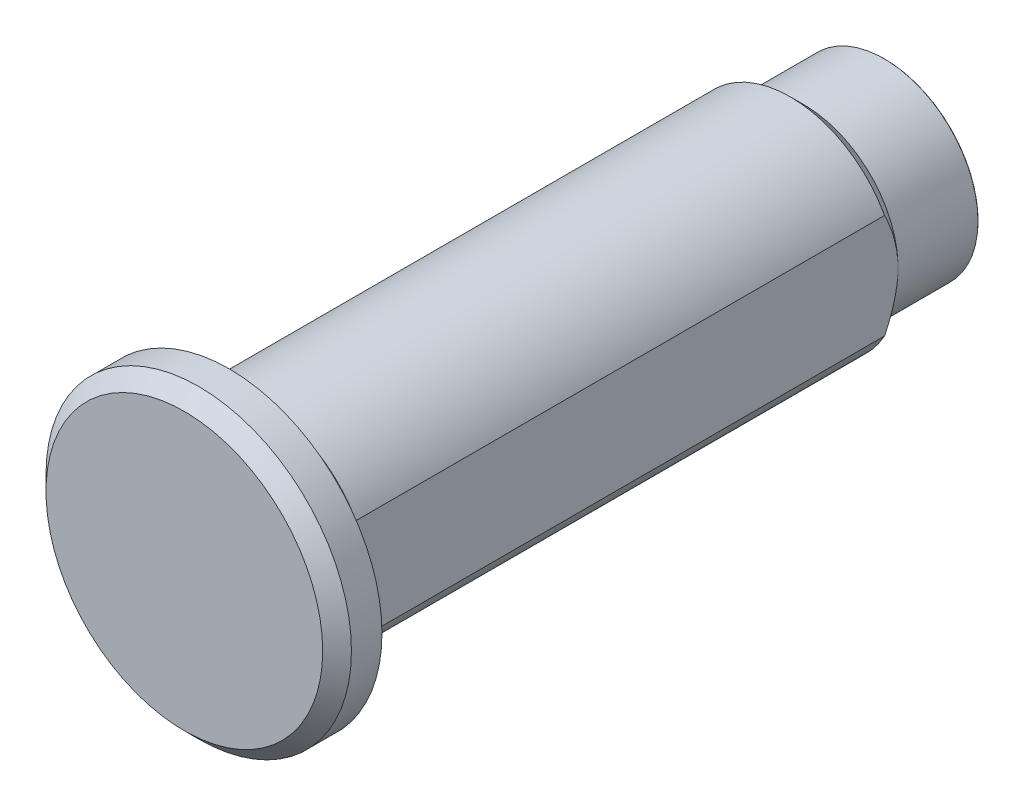
ISO-10303-21;
HEADER;
FILE_DESCRIPTION(('STEP AP214'),'2;1');
FILE_NAME('part.step','',(''),(''),'','','');
FILE_SCHEMA(('AUTOMOTIVE_DESIGN { 1 0 10303 214 1 1 1 1 }'));
ENDSEC;
DATA;
#1=APPLICATION_CONTEXT('core data for automotive mechanical design processes');
#2=APPLICATION_PROTOCOL_DEFINITION('international standard','automotive_design',2000,#1);
#3=PRODUCT_CONTEXT('',#1,'mechanical');
#4=PRODUCT('Part','Part','',(#3));
#5=PRODUCT_RELATED_PRODUCT_CATEGORY('part','',(#4));
#6=PRODUCT_DEFINITION_FORMATION('','',#4);
#7=PRODUCT_DEFINITION_CONTEXT('part definition',#1,'design');
#8=PRODUCT_DEFINITION('design','',#6,#7);
#9=PRODUCT_DEFINITION_SHAPE('','',#8);
#10=(LENGTH_UNIT() NAMED_UNIT(*) SI_UNIT(.MILLI.,.METRE.));
#11=(NAMED_UNIT(*) PLANE_ANGLE_UNIT() SI_UNIT($,.RADIAN.));
#12=(NAMED_UNIT(*) SI_UNIT($,.STERADIAN.) SOLID_ANGLE_UNIT());
#13=UNCERTAINTY_MEASURE_WITH_UNIT(LENGTH_MEASURE(1.E-05),#10,'distance_accuracy_value','');
#14=(GEOMETRIC_REPRESENTATION_CONTEXT(3) GLOBAL_UNCERTAINTY_ASSIGNED_CONTEXT((#13)) GLOBAL_UNIT_ASSIGNED_CONTEXT((#10,
#11,#12)) REPRESENTATION_CONTEXT('',''));
#15=CARTESIAN_POINT('',(0.,0.,0.));
#16=DIRECTION('',(0.,0.,1.));
#17=DIRECTION('',(1.,0.,0.));
#18=AXIS2_PLACEMENT_3D('',#15,#16,#17);
#19=CARTESIAN_POINT('',(0.,0.,36.5));
#20=DIRECTION('',(0.,0.,1.));
#21=DIRECTION('',(1.,0.,0.));
#22=AXIS2_PLACEMENT_3D('',#19,#20,#21);
#23=PLANE('',#22);
#24=CARTESIAN_POINT('',(0.,0.,36.5));
#25=DIRECTION('',(0.,0.,1.));
#26=DIRECTION('',(1.,0.,0.));
#27=AXIS2_PLACEMENT_3D('',#24,#25,#26);
#28=CIRCLE('',#27,5.2);
#29=CARTESIAN_POINT('',(5.2,0.,36.5));
#30=VERTEX_POINT('',#29);
#31=EDGE_CURVE('E119',#30,#30,#28,.T.);
#32=ORIENTED_EDGE('',*,*,#31,.T.);
#33=EDGE_LOOP('',(#32));
#34=FACE_BOUND('',#33,.T.);
#35=CARTESIAN_POINT('',(0.,0.,36.5));
#36=DIRECTION('',(0.,0.,-1.));
#37=DIRECTION('',(1.,0.,0.));
#38=AXIS2_PLACEMENT_3D('',#35,#36,#37);
#39=CIRCLE('',#38,6.);
#40=CARTESIAN_POINT('',(6.,0.,36.5));
#41=VERTEX_POINT('',#40);
#42=EDGE_CURVE('E249',#41,#41,#39,.T.);
#43=ORIENTED_EDGE('',*,*,#42,.T.);
#44=EDGE_LOOP('',(#43));
#45=FACE_BOUND('',#44,.T.);
#46=ADVANCED_FACE('F43',(#34,#45),#23,.F.);
#47=CARTESIAN_POINT('',(0.,0.,19.9875));
#48=DIRECTION('',(0.,0.,-1.));
#49=DIRECTION('',(-1.,0.,0.));
#50=AXIS2_PLACEMENT_3D('',#47,#48,#49);
#51=CYLINDRICAL_SURFACE('',#50,6.);
#52=DIRECTION('',(0.,0.,1.));
#53=VECTOR('',#52,1.);
#54=CARTESIAN_POINT('',(5.25,2.90473750965556,4.5));
#55=LINE('',#54,#53);
#56=CARTESIAN_POINT('',(5.25,2.90473750952479,34.6999999997299));
#57=VERTEX_POINT('',#56);
#58=CARTESIAN_POINT('',(5.25,2.90473750933291,5.27500000053737));
#59=VERTEX_POINT('',#58);
#60=EDGE_CURVE('E96',#57,#59,#55,.F.);
#61=ORIENTED_EDGE('',*,*,#60,.T.);
#62=CARTESIAN_POINT('',(0.,0.,5.27500000038117));
#63=DIRECTION('',(0.,0.,1.));
#64=DIRECTION('',(1.,0.,0.));
#65=AXIS2_PLACEMENT_3D('',#62,#63,#64);
#66=CIRCLE('',#65,5.99999999968759);
#67=CARTESIAN_POINT('',(-5.25,2.90473750933291,5.27500000038117));
#68=VERTEX_POINT('',#67);
#69=EDGE_CURVE('E90',#68,#59,#66,.F.);
#70=ORIENTED_EDGE('',*,*,#69,.F.);
#71=DIRECTION('',(0.,0.,-1.));
#72=VECTOR('',#71,1.);
#73=CARTESIAN_POINT('',(-5.25,2.90473750965557,4.5));
#74=LINE('',#73,#72);
#75=CARTESIAN_POINT('',(-5.25,2.90473750965557,34.6999999996666));
#76=VERTEX_POINT('',#75);
#77=EDGE_CURVE('E97',#68,#76,#74,.F.);
#78=ORIENTED_EDGE('',*,*,#77,.T.);
#79=CARTESIAN_POINT('',(0.,0.,34.7));
#80=DIRECTION('',(0.,0.,-1.));
#81=DIRECTION('',(-1.,0.,0.));
#82=AXIS2_PLACEMENT_3D('',#79,#80,#81);
#83=CIRCLE('',#82,6.);
#84=EDGE_CURVE('E104',#76,#57,#83,.T.);
#85=ORIENTED_EDGE('',*,*,#84,.T.);
#86=EDGE_LOOP('',(#61,#70,#78,#85));
#87=FACE_BOUND('',#86,.T.);
#88=ADVANCED_FACE('F101',(#87),#51,.T.);
#89=CARTESIAN_POINT('',(-5.25,2.90473750965557,4.5));
#90=DIRECTION('',(1.,0.,0.));
#91=DIRECTION('',(0.,0.,-1.));
#92=AXIS2_PLACEMENT_3D('',#89,#90,#91);
#93=PLANE('',#92);
#94=DIRECTION('',(0.,0.,-1.));
#95=VECTOR('',#94,1.);
#96=CARTESIAN_POINT('',(-5.25,-2.90473750965556,19.9875));
#97=LINE('',#96,#95);
#98=CARTESIAN_POINT('',(-5.25,-2.90473750965556,34.6999999996666));
#99=VERTEX_POINT('',#98);
#100=CARTESIAN_POINT('',(-5.25,-2.90473750952292,5.27500000028258));
#101=VERTEX_POINT('',#100);
#102=EDGE_CURVE('E112',#99,#101,#97,.T.);
#103=ORIENTED_EDGE('',*,*,#102,.F.);
#104=CARTESIAN_POINT('',(-5.25000000014036,2.90473750942371,34.6999999995211));
#105=CARTESIAN_POINT('',(-5.25000000005173,2.80472364249901,34.7484127450891));
#106=CARTESIAN_POINT('',(-5.25000000001417,2.70396282733897,34.7952855235719));
#107=CARTESIAN_POINT('',(-5.24999999998582,2.50082737605574,34.8855062666034));
#108=CARTESIAN_POINT('',(-5.24999999999506,2.39845207813469,34.9288527383425));
#109=CARTESIAN_POINT('',(-5.25000000000994,2.08773843913795,35.0533212458188));
#110=CARTESIAN_POINT('',(-5.25000000000253,1.87688996107605,35.1283396214557));
#111=CARTESIAN_POINT('',(-5.24999999999748,1.44960363662519,35.2573261898471));
#112=CARTESIAN_POINT('',(-5.24999999999981,1.23319217234919,35.3113792075725));
#113=CARTESIAN_POINT('',(-5.2500000000001,0.905325852034298,35.373595250369));
#114=CARTESIAN_POINT('',(-5.24999999999966,0.795619790655084,35.3911808711925));
#115=CARTESIAN_POINT('',(-5.25000000000034,0.575357914022909,35.4196935829661));
#116=CARTESIAN_POINT('',(-5.25000000000146,0.464802371205453,35.4306227252794));
#117=CARTESIAN_POINT('',(-5.24999999999922,0.29509634463016,35.4420423388852));
#118=CARTESIAN_POINT('',(-5.24999999999772,0.236104114980286,35.4450243697781));
#119=CARTESIAN_POINT('',(-5.25000000000228,0.118077181188113,35.449003787367));
#120=CARTESIAN_POINT('',(-5.25000000000834,0.0590425019471778,35.4500019332948));
#121=CARTESIAN_POINT('',(-5.25000000001943,-0.159349296907837,35.4499947849231));
#122=CARTESIAN_POINT('',(-5.25000000000521,-0.318755574520894,35.4427049828945));
#123=CARTESIAN_POINT('',(-5.24999999999479,-0.636346232490033,35.4139454844968));
#124=CARTESIAN_POINT('',(-5.2499999999986,-0.794529662094433,35.3924656962197));
#125=CARTESIAN_POINT('',(-5.25000000000141,-1.10921364817354,35.3363470199826));
#126=CARTESIAN_POINT('',(-5.25000000000038,-1.26570419082673,35.3016525748727));
#127=CARTESIAN_POINT('',(-5.24999999999962,-1.57567343162152,35.2206901976528));
#128=CARTESIAN_POINT('',(-5.24999999999989,-1.72915105880267,35.1744182277871));
#129=CARTESIAN_POINT('',(-5.25000000000012,-2.05674952786255,35.0639273749439));
#130=CARTESIAN_POINT('',(-5.25000000000002,-2.23030107141181,34.9980280715673));
#131=CARTESIAN_POINT('',(-5.24999999999999,-2.48651857129637,34.8914452741755));
#132=CARTESIAN_POINT('',(-5.24999999999999,-2.57090217438363,34.8547943626977));
#133=CARTESIAN_POINT('',(-5.25000000000001,-2.7386063393495,34.7791153486981));
#134=CARTESIAN_POINT('',(-5.25000000000001,-2.82192681236011,34.7400870490024));
#135=CARTESIAN_POINT('',(-5.25,-2.90473750942253,34.699999999446));
#136=B_SPLINE_CURVE_WITH_KNOTS('',3,(#104,#105,#106,#107,#108,#109,#110,#111,#112,#113,#114,
#115,#116,#117,#118,#119,#120,#121,#122,#123,#124,#125,#126,#127,#128,#129,#130,#131,#132,#133,
#134,#135),.UNSPECIFIED.,.F.,.F.,(4,2,2,2,2,2,2,2,2,2,2,2,2,2,2,4),(0.,0.333326180451042,
0.666792743150029,1.33732321864376,2.00511172853406,2.33826323974814,2.67131202983978,
2.8484843643836,3.02558888210336,3.50357473038419,3.98190088835122,4.46226063118257,
4.9427881374586,5.49923054934731,5.77520069740091,6.05119376488153),.UNSPECIFIED.);
#137=EDGE_CURVE('E80',#76,#99,#136,.T.);
#138=ORIENTED_EDGE('',*,*,#137,.F.);
#139=ORIENTED_EDGE('',*,*,#77,.F.);
#140=CARTESIAN_POINT('',(-5.25000000014974,-2.90473750942195,5.27500000049974));
#141=CARTESIAN_POINT('',(-5.2500000000552,-2.80472364249426,5.22658725493416));
#142=CARTESIAN_POINT('',(-5.25000000001512,-2.70396282733191,5.17971447645242));
#143=CARTESIAN_POINT('',(-5.24999999998487,-2.50082737604467,5.08949373342163));
#144=CARTESIAN_POINT('',(-5.24999999999472,-2.3984520781219,5.04614726168227));
#145=CARTESIAN_POINT('',(-5.25000000001062,-2.08773843912013,4.92167875420576));
#146=CARTESIAN_POINT('',(-5.25000000000278,-1.87688996105472,4.8466603785695));
#147=CARTESIAN_POINT('',(-5.24999999999723,-1.44960363659879,4.71767381018028));
#148=CARTESIAN_POINT('',(-5.2499999999995,-1.23319217232128,4.66362079245634));
#149=CARTESIAN_POINT('',(-5.25000000000025,-0.905325852004177,4.60140474966175));
#150=CARTESIAN_POINT('',(-5.25000000000007,-0.795619790624202,4.58381912883896));
#151=CARTESIAN_POINT('',(-5.24999999999993,-0.575357913990496,4.55530641706711));
#152=CARTESIAN_POINT('',(-5.24999999999999,-0.46480237117227,4.54437727475502));
#153=CARTESIAN_POINT('',(-5.25000000000001,-0.295096344601979,4.53295766114993));
#154=CARTESIAN_POINT('',(-5.25,-0.236104114957861,4.52997563025703));
#155=CARTESIAN_POINT('',(-5.25,-0.118077181177136,4.52599621267076));
#156=CARTESIAN_POINT('',(-5.25,-0.0590425019418932,4.52499806674567));
#157=CARTESIAN_POINT('',(-5.25,0.159349296909903,4.52500521512197));
#158=CARTESIAN_POINT('',(-5.25,0.318755574525442,4.53229501714478));
#159=CARTESIAN_POINT('',(-5.25,0.636346232499038,4.56105451553863));
#160=CARTESIAN_POINT('',(-5.25,0.794529662105417,4.58253430381755));
#161=CARTESIAN_POINT('',(-5.25,1.10921364818837,4.63865298005651));
#162=CARTESIAN_POINT('',(-5.25,1.26570419084342,4.67334742516632));
#163=CARTESIAN_POINT('',(-5.25,1.57567343164181,4.75430980238672));
#164=CARTESIAN_POINT('',(-5.25,1.72915105882469,4.80058177225298));
#165=CARTESIAN_POINT('',(-5.25,2.05674952787655,4.91107262509329));
#166=CARTESIAN_POINT('',(-5.25,2.23030107141637,4.9769719284656));
#167=CARTESIAN_POINT('',(-5.25,2.4865185712875,5.08355472585011));
#168=CARTESIAN_POINT('',(-5.25,2.57090217437057,5.12020563732544));
#169=CARTESIAN_POINT('',(-5.25,2.73860633932816,5.19588465131993));
#170=CARTESIAN_POINT('',(-5.25,2.82192681233468,5.23491295101292));
#171=CARTESIAN_POINT('',(-5.25,2.90473750939307,5.2750000005665));
#172=B_SPLINE_CURVE_WITH_KNOTS('',3,(#140,#141,#142,#143,#144,#145,#146,#147,#148,#149,#150,
#151,#152,#153,#154,#155,#156,#157,#158,#159,#160,#161,#162,#163,#164,#165,#166,#167,#168,#169,
#170,#171),.UNSPECIFIED.,.F.,.F.,(4,2,2,2,2,2,2,2,2,2,2,2,2,2,2,4),(0.,0.333326180456037,
0.666792743160119,1.33732321866301,2.00511172855676,2.33826323977274,2.67131202986644,
2.84848436439296,3.02558888209554,3.50357473038353,3.98190088835662,4.46226063119367,
4.94278813747504,5.49923054933277,5.7752006973719,6.05119376483797),.UNSPECIFIED.);
#173=EDGE_CURVE('E86',#101,#68,#172,.T.);
#174=ORIENTED_EDGE('',*,*,#173,.F.);
#175=EDGE_LOOP('',(#103,#138,#139,#174));
#176=FACE_BOUND('',#175,.T.);
#177=ADVANCED_FACE('F106',(#176),#93,.F.);
#178=CARTESIAN_POINT('',(0.,0.,5.27500000038117));
#179=DIRECTION('',(0.,0.,1.));
#180=DIRECTION('',(1.,0.,0.));
#181=AXIS2_PLACEMENT_3D('',#178,#179,#180);
#182=CONICAL_SURFACE('',#181,5.99999999968759,0.785398162480619);
#183=CARTESIAN_POINT('',(5.25000000005051,2.90473750940096,5.27500000054309));
#184=CARTESIAN_POINT('',(5.25000000001862,2.80472364248735,5.22658725495055));
#185=CARTESIAN_POINT('',(5.2500000000051,2.70396282733174,5.17971447645771));
#186=CARTESIAN_POINT('',(5.2499999999949,2.50082737605147,5.08949373341929));
#187=CARTESIAN_POINT('',(5.24999999999822,2.39845207812897,5.0461472616834));
#188=CARTESIAN_POINT('',(5.25000000000358,2.08773843913055,4.92167875421336));
#189=CARTESIAN_POINT('',(5.25000000000094,1.87688996107021,4.84666037857581));
#190=CARTESIAN_POINT('',(5.24999999999907,1.44960363662393,4.71767381018625));
#191=CARTESIAN_POINT('',(5.24999999999983,1.23319217235102,4.66362079246318));
#192=CARTESIAN_POINT('',(5.25000000000008,0.90532585204112,4.60140474966815));
#193=CARTESIAN_POINT('',(5.25000000000002,0.795619790663541,4.58381912884493));
#194=CARTESIAN_POINT('',(5.24999999999998,0.57535791403456,4.55530641707194));
#195=CARTESIAN_POINT('',(5.25,0.464802371218662,4.54437727475916));
#196=CARTESIAN_POINT('',(5.25,0.295096344642614,4.53295766115212));
#197=CARTESIAN_POINT('',(5.25,0.236104114990406,4.5299756302584));
#198=CARTESIAN_POINT('',(5.25,0.118077181193477,4.52599621267104));
#199=CARTESIAN_POINT('',(5.25,0.0590425019501209,4.52499806674567));
#200=CARTESIAN_POINT('',(5.25,-0.159349296909819,4.52500521512197));
#201=CARTESIAN_POINT('',(5.25,-0.318755574525381,4.53229501714477));
#202=CARTESIAN_POINT('',(5.25,-0.63634623249902,4.56105451553863));
#203=CARTESIAN_POINT('',(5.25,-0.794529662105418,4.58253430381755));
#204=CARTESIAN_POINT('',(5.25,-1.1092136481884,4.63865298005652));
#205=CARTESIAN_POINT('',(5.25,-1.26570419084347,4.67334742516633));
#206=CARTESIAN_POINT('',(5.25,-1.57567343164188,4.75430980238674));
#207=CARTESIAN_POINT('',(5.25,-1.72915105882477,4.800581772253));
#208=CARTESIAN_POINT('',(5.25,-2.05674952787636,4.91107262509323));
#209=CARTESIAN_POINT('',(5.25,-2.2303010714159,4.97697192846542));
#210=CARTESIAN_POINT('',(5.25,-2.48651857128664,5.08355472584974));
#211=CARTESIAN_POINT('',(5.25,-2.57090217436958,5.12020563732501));
#212=CARTESIAN_POINT('',(5.25,-2.73860633932693,5.19588465131936));
#213=CARTESIAN_POINT('',(5.25,-2.82192681233332,5.23491295101227));
#214=CARTESIAN_POINT('',(5.25,-2.90473750939159,5.27500000056579));
#215=B_SPLINE_CURVE_WITH_KNOTS('',3,(#183,#184,#185,#186,#187,#188,#189,#190,#191,#192,#193,
#194,#195,#196,#197,#198,#199,#200,#201,#202,#203,#204,#205,#206,#207,#208,#209,#210,#211,#212,
#213,#214),.UNSPECIFIED.,.F.,.F.,(4,2,2,2,2,2,2,2,2,2,2,2,2,2,2,4),(0.,0.333326180451773,
0.66679274315076,1.33732321864137,2.00511172852079,2.33826323972994,2.6713120298169,
2.84848436436777,3.02558888209469,3.50357473038276,3.9819008883559,4.46226063119299,
4.9427881374744,5.49923054933124,5.77520069736994,6.05119376483559),.UNSPECIFIED.);
#216=CARTESIAN_POINT('',(5.25,-2.90473750951956,5.27500000028095));
#217=VERTEX_POINT('',#216);
#218=EDGE_CURVE('E144',#59,#217,#215,.T.);
#219=ORIENTED_EDGE('',*,*,#218,.T.);
#220=CARTESIAN_POINT('',(0.,0.,5.275));
#221=DIRECTION('',(0.,0.,-1.));
#222=DIRECTION('',(-1.,0.,0.));
#223=AXIS2_PLACEMENT_3D('',#220,#221,#222);
#224=CIRCLE('',#223,6.);
#225=EDGE_CURVE('E93',#101,#217,#224,.F.);
#226=ORIENTED_EDGE('',*,*,#225,.F.);
#227=ORIENTED_EDGE('',*,*,#173,.T.);
#228=ORIENTED_EDGE('',*,*,#69,.T.);
#229=EDGE_LOOP('',(#219,#226,#227,#228));
#230=FACE_BOUND('',#229,.T.);
#231=CARTESIAN_POINT('',(0.,0.,4.49999999966622));
#232=DIRECTION('',(0.,0.,-1.));
#233=DIRECTION('',(-1.,0.,0.));
#234=AXIS2_PLACEMENT_3D('',#231,#232,#233);
#235=CIRCLE('',#234,5.225);
#236=CARTESIAN_POINT('',(-5.225,0.,4.49999999966622));
#237=VERTEX_POINT('',#236);
#238=EDGE_CURVE('E528',#237,#237,#235,.T.);
#239=ORIENTED_EDGE('',*,*,#238,.F.);
#240=EDGE_LOOP('',(#239));
#241=FACE_BOUND('',#240,.T.);
#242=ADVANCED_FACE('F88',(#230,#241),#182,.T.);
#243=CARTESIAN_POINT('',(5.25,-2.90473750965557,4.5));
#244=DIRECTION('',(-1.,0.,0.));
#245=DIRECTION('',(0.,0.,1.));
#246=AXIS2_PLACEMENT_3D('',#243,#244,#245);
#247=PLANE('',#246);
#248=ORIENTED_EDGE('',*,*,#60,.F.);
#249=CARTESIAN_POINT('',(5.25000000012699,-2.90473750944238,34.6999999995048));
#250=CARTESIAN_POINT('',(5.25000000004681,-2.80472364251846,34.7484127450773));
#251=CARTESIAN_POINT('',(5.25000000001282,-2.70396282735821,34.7952855235623));
#252=CARTESIAN_POINT('',(5.24999999998717,-2.50082737607363,34.8855062665964));
#253=CARTESIAN_POINT('',(5.24999999999552,-2.39845207815144,34.9288527383357));
#254=CARTESIAN_POINT('',(5.25000000000901,-2.08773843915195,35.0533212458132));
#255=CARTESIAN_POINT('',(5.25000000000235,-1.87688996108864,35.1283396214514));
#256=CARTESIAN_POINT('',(5.24999999999766,-1.44960363663653,35.2573261898442));
#257=CARTESIAN_POINT('',(5.24999999999957,-1.23319217236072,35.3113792075698));
#258=CARTESIAN_POINT('',(5.25000000000021,-0.905325852046081,35.3735952503671));
#259=CARTESIAN_POINT('',(5.25000000000006,-0.795619790666899,35.3911808711909));
#260=CARTESIAN_POINT('',(5.24999999999994,-0.575357914034708,35.4196935829647));
#261=CARTESIAN_POINT('',(5.24999999999999,-0.464802371217202,35.4306227252778));
#262=CARTESIAN_POINT('',(5.25000000000001,-0.295096344640089,35.442042338885));
#263=CARTESIAN_POINT('',(5.25,-0.236104114988437,35.4450243697787));
#264=CARTESIAN_POINT('',(5.25,-0.118077181192626,35.449003787366));
#265=CARTESIAN_POINT('',(5.25,-0.0590425019498308,35.4500019332914));
#266=CARTESIAN_POINT('',(5.25,0.159349296907621,35.4499947849151));
#267=CARTESIAN_POINT('',(5.25,0.318755574521257,35.4427049828924));
#268=CARTESIAN_POINT('',(5.25,0.636346232491056,35.4139454844988));
#269=CARTESIAN_POINT('',(5.25,0.794529662095541,35.3924656962201));
#270=CARTESIAN_POINT('',(5.25,1.10921364817474,35.3363470199818));
#271=CARTESIAN_POINT('',(5.25,1.26570419082793,35.3016525748723));
#272=CARTESIAN_POINT('',(5.25,1.5756734316226,35.2206901976527));
#273=CARTESIAN_POINT('',(5.25,1.72915105880364,35.1744182277868));
#274=CARTESIAN_POINT('',(5.25,2.05674952785936,35.0639273749449));
#275=CARTESIAN_POINT('',(5.25,2.23030107140467,34.99802807157));
#276=CARTESIAN_POINT('',(5.25,2.48651857128372,34.8914452741809));
#277=CARTESIAN_POINT('',(5.25,2.57090217436935,34.854794362704));
#278=CARTESIAN_POINT('',(5.25,2.73860633933196,34.7791153487062));
#279=CARTESIAN_POINT('',(5.25,2.82192681234095,34.7400870490114));
#280=CARTESIAN_POINT('',(5.25,2.90473750940176,34.699999999456));
#281=B_SPLINE_CURVE_WITH_KNOTS('',3,(#249,#250,#251,#252,#253,#254,#255,#256,#257,#258,#259,
#260,#261,#262,#263,#264,#265,#266,#267,#268,#269,#270,#271,#272,#273,#274,#275,#276,#277,#278,
#279,#280),.UNSPECIFIED.,.F.,.F.,(4,2,2,2,2,2,2,2,2,2,2,2,2,2,2,4),(0.,0.333326180454525,
0.666792743156902,1.337323218656,2.00511172854588,2.33826323975998,2.67131202985182,
2.84848436440103,3.02558888212626,3.50357473040855,3.98190088837592,4.46226063120729,
4.94278813748299,5.4992305493589,5.77520069740696,6.05119376488195),.UNSPECIFIED.);
#282=CARTESIAN_POINT('',(5.25,-2.90473750953555,34.6999999997247));
#283=VERTEX_POINT('',#282);
#284=EDGE_CURVE('E60',#283,#57,#281,.T.);
#285=ORIENTED_EDGE('',*,*,#284,.F.);
#286=DIRECTION('',(0.,0.,-1.));
#287=VECTOR('',#286,1.);
#288=CARTESIAN_POINT('',(5.25,-2.90473750965557,19.9875));
#289=LINE('',#288,#287);
#290=EDGE_CURVE('E258',#217,#283,#289,.F.);
#291=ORIENTED_EDGE('',*,*,#290,.F.);
#292=ORIENTED_EDGE('',*,*,#218,.F.);
#293=EDGE_LOOP('',(#248,#285,#291,#292));
#294=FACE_BOUND('',#293,.T.);
#295=ADVANCED_FACE('F167',(#294),#247,.F.);
#296=CARTESIAN_POINT('',(0.,0.,34.6999999997024));
#297=DIRECTION('',(0.,0.,-1.));
#298=DIRECTION('',(-1.,0.,0.));
#299=AXIS2_PLACEMENT_3D('',#296,#297,#298);
#300=CONICAL_SURFACE('',#299,5.99999999963075,0.785398162473743);
#301=ORIENTED_EDGE('',*,*,#284,.T.);
#302=ORIENTED_EDGE('',*,*,#84,.F.);
#303=ORIENTED_EDGE('',*,*,#137,.T.);
#304=CARTESIAN_POINT('',(0.,0.,34.7));
#305=DIRECTION('',(0.,0.,-1.));
#306=DIRECTION('',(-1.,0.,0.));
#307=AXIS2_PLACEMENT_3D('',#304,#305,#306);
#308=CIRCLE('',#307,6.);
#309=EDGE_CURVE('E260',#283,#99,#308,.T.);
#310=ORIENTED_EDGE('',*,*,#309,.F.);
#311=EDGE_LOOP('',(#301,#302,#303,#310));
#312=FACE_BOUND('',#311,.T.);
#313=CARTESIAN_POINT('',(0.,0.,35.5000000004111));
#314=DIRECTION('',(0.,0.,1.));
#315=DIRECTION('',(1.,0.,0.));
#316=AXIS2_PLACEMENT_3D('',#313,#314,#315);
#317=CIRCLE('',#316,5.2);
#318=CARTESIAN_POINT('',(5.2,0.,35.5000000004111));
#319=VERTEX_POINT('',#318);
#320=EDGE_CURVE('E242',#319,#319,#317,.T.);
#321=ORIENTED_EDGE('',*,*,#320,.F.);
#322=EDGE_LOOP('',(#321));
#323=FACE_BOUND('',#322,.T.);
#324=ADVANCED_FACE('F212',(#312,#323),#300,.T.);
#325=CARTESIAN_POINT('',(0.,0.,19.9875));
#326=DIRECTION('',(0.,0.,-1.));
#327=DIRECTION('',(-1.,0.,0.));
#328=AXIS2_PLACEMENT_3D('',#325,#326,#327);
#329=CYLINDRICAL_SURFACE('',#328,6.);
#330=ORIENTED_EDGE('',*,*,#290,.T.);
#331=ORIENTED_EDGE('',*,*,#309,.T.);
#332=ORIENTED_EDGE('',*,*,#102,.T.);
#333=ORIENTED_EDGE('',*,*,#225,.T.);
#334=EDGE_LOOP('',(#330,#331,#332,#333));
#335=FACE_BOUND('',#334,.T.);
#336=ADVANCED_FACE('F200',(#335),#329,.T.);
#337=CARTESIAN_POINT('',(0.,0.,36.5));
#338=DIRECTION('',(0.,0.,-1.));
#339=DIRECTION('',(-1.,0.,0.));
#340=AXIS2_PLACEMENT_3D('',#337,#338,#339);
#341=CYLINDRICAL_SURFACE('',#340,5.2);
#342=ORIENTED_EDGE('',*,*,#31,.F.);
#343=EDGE_LOOP('',(#342));
#344=FACE_BOUND('',#343,.T.);
#345=ORIENTED_EDGE('',*,*,#320,.T.);
#346=EDGE_LOOP('',(#345));
#347=FACE_BOUND('',#346,.T.);
#348=ADVANCED_FACE('F178',(#344,#347),#341,.T.);
#349=CARTESIAN_POINT('',(0.,0.,37.65));
#350=DIRECTION('',(0.,0.,-1.));
#351=DIRECTION('',(-1.,0.,0.));
#352=AXIS2_PLACEMENT_3D('',#349,#350,#351);
#353=CYLINDRICAL_SURFACE('',#352,7.8);
#354=CARTESIAN_POINT('',(0.,0.,37.45));
#355=DIRECTION('',(0.,0.,1.));
#356=DIRECTION('',(1.,0.,0.));
#357=AXIS2_PLACEMENT_3D('',#354,#355,#356);
#358=CIRCLE('',#357,7.8);
#359=CARTESIAN_POINT('',(7.8,0.,37.45));
#360=VERTEX_POINT('',#359);
#361=EDGE_CURVE('E12',#360,#360,#358,.T.);
#362=ORIENTED_EDGE('',*,*,#361,.T.);
#363=EDGE_LOOP('',(#362));
#364=FACE_BOUND('',#363,.T.);
#365=CARTESIAN_POINT('',(0.,0.,36.5));
#366=DIRECTION('',(0.,0.,-1.));
#367=DIRECTION('',(1.,0.,0.));
#368=AXIS2_PLACEMENT_3D('',#365,#366,#367);
#369=CIRCLE('',#368,7.8);
#370=CARTESIAN_POINT('',(7.8,0.,36.5));
#371=VERTEX_POINT('',#370);
#372=EDGE_CURVE('E243',#371,#371,#369,.T.);
#373=ORIENTED_EDGE('',*,*,#372,.T.);
#374=EDGE_LOOP('',(#373));
#375=FACE_BOUND('',#374,.T.);
#376=ADVANCED_FACE('F219',(#364,#375),#353,.F.);
#377=CARTESIAN_POINT('',(0.,0.,37.65));
#378=DIRECTION('',(0.,0.,1.));
#379=DIRECTION('',(1.,0.,0.));
#380=AXIS2_PLACEMENT_3D('',#377,#378,#379);
#381=PLANE('',#380);
#382=CARTESIAN_POINT('',(0.,0.,37.65));
#383=DIRECTION('',(0.,0.,1.));
#384=DIRECTION('',(1.,0.,0.));
#385=AXIS2_PLACEMENT_3D('',#382,#383,#384);
#386=CIRCLE('',#385,6.2);
#387=CARTESIAN_POINT('',(6.2,0.,37.65));
#388=VERTEX_POINT('',#387);
#389=EDGE_CURVE('E52',#388,#388,#386,.T.);
#390=ORIENTED_EDGE('',*,*,#389,.T.);
#391=EDGE_LOOP('',(#390));
#392=FACE_BOUND('',#391,.T.);
#393=CARTESIAN_POINT('',(0.,0.,37.65));
#394=DIRECTION('',(0.,0.,1.));
#395=DIRECTION('',(1.,0.,0.));
#396=AXIS2_PLACEMENT_3D('',#393,#394,#395);
#397=CIRCLE('',#396,7.6);
#398=CARTESIAN_POINT('',(7.6,0.,37.65));
#399=VERTEX_POINT('',#398);
#400=EDGE_CURVE('E344',#399,#399,#397,.F.);
#401=ORIENTED_EDGE('',*,*,#400,.T.);
#402=EDGE_LOOP('',(#401));
#403=FACE_BOUND('',#402,.T.);
#404=ADVANCED_FACE('F348',(#392,#403),#381,.F.);
#405=CARTESIAN_POINT('',(0.,0.,37.65));
#406=DIRECTION('',(0.,0.,-1.));
#407=DIRECTION('',(-1.,0.,0.));
#408=AXIS2_PLACEMENT_3D('',#405,#406,#407);
#409=CYLINDRICAL_SURFACE('',#408,6.);
#410=CARTESIAN_POINT('',(0.,0.,37.45));
#411=DIRECTION('',(0.,0.,1.));
#412=DIRECTION('',(1.,0.,0.));
#413=AXIS2_PLACEMENT_3D('',#410,#411,#412);
#414=CIRCLE('',#413,6.);
#415=CARTESIAN_POINT('',(6.,0.,37.45));
#416=VERTEX_POINT('',#415);
#417=EDGE_CURVE('E341',#416,#416,#414,.F.);
#418=ORIENTED_EDGE('',*,*,#417,.T.);
#419=EDGE_LOOP('',(#418));
#420=FACE_BOUND('',#419,.T.);
#421=ORIENTED_EDGE('',*,*,#42,.F.);
#422=EDGE_LOOP('',(#421));
#423=FACE_BOUND('',#422,.T.);
#424=ADVANCED_FACE('F232',(#420,#423),#409,.T.);
#425=CARTESIAN_POINT('',(0.,0.,39.));
#426=DIRECTION('',(0.,0.,1.));
#427=DIRECTION('',(1.,0.,0.));
#428=AXIS2_PLACEMENT_3D('',#425,#426,#427);
#429=PLANE('',#428);
#430=CARTESIAN_POINT('',(0.,0.,39.));
#431=DIRECTION('',(0.,0.,1.));
#432=DIRECTION('',(1.,0.,0.));
#433=AXIS2_PLACEMENT_3D('',#430,#431,#432);
#434=CIRCLE('',#433,7.70000000071798);
#435=CARTESIAN_POINT('',(7.70000000071798,0.,39.));
#436=VERTEX_POINT('',#435);
#437=EDGE_CURVE('E338',#436,#436,#434,.T.);
#438=ORIENTED_EDGE('',*,*,#437,.T.);
#439=EDGE_LOOP('',(#438));
#440=FACE_BOUND('',#439,.T.);
#441=ADVANCED_FACE('F227',(#440),#429,.T.);
#442=CARTESIAN_POINT('',(0.,0.,39.));
#443=DIRECTION('',(0.,0.,-1.));
#444=DIRECTION('',(-1.,0.,0.));
#445=AXIS2_PLACEMENT_3D('',#442,#443,#444);
#446=CYLINDRICAL_SURFACE('',#445,8.5);
#447=CARTESIAN_POINT('',(0.,0.,38.1999999992821));
#448=DIRECTION('',(0.,0.,1.));
#449=DIRECTION('',(1.,0.,0.));
#450=AXIS2_PLACEMENT_3D('',#447,#448,#449);
#451=CIRCLE('',#450,8.5);
#452=CARTESIAN_POINT('',(8.5,0.,38.1999999992821));
#453=VERTEX_POINT('',#452);
#454=EDGE_CURVE('E237',#453,#453,#451,.F.);
#455=ORIENTED_EDGE('',*,*,#454,.T.);
#456=EDGE_LOOP('',(#455));
#457=FACE_BOUND('',#456,.T.);
#458=CARTESIAN_POINT('',(0.,0.,36.5));
#459=DIRECTION('',(0.,0.,-1.));
#460=DIRECTION('',(1.,0.,0.));
#461=AXIS2_PLACEMENT_3D('',#458,#459,#460);
#462=CIRCLE('',#461,8.5);
#463=CARTESIAN_POINT('',(8.5,0.,36.5));
#464=VERTEX_POINT('',#463);
#465=EDGE_CURVE('E240',#464,#464,#462,.T.);
#466=ORIENTED_EDGE('',*,*,#465,.F.);
#467=EDGE_LOOP('',(#466));
#468=FACE_BOUND('',#467,.T.);
#469=ADVANCED_FACE('F209',(#457,#468),#446,.T.);
#470=ORIENTED_EDGE('',*,*,#372,.F.);
#471=EDGE_LOOP('',(#470));
#472=FACE_BOUND('',#471,.T.);
#473=ORIENTED_EDGE('',*,*,#465,.T.);
#474=EDGE_LOOP('',(#473));
#475=FACE_BOUND('',#474,.T.);
#476=ADVANCED_FACE('F199',(#472,#475),#23,.F.);
#477=CARTESIAN_POINT('',(0.,0.,0.));
#478=DIRECTION('',(0.,0.,1.));
#479=DIRECTION('',(1.,0.,0.));
#480=AXIS2_PLACEMENT_3D('',#477,#478,#479);
#481=CYLINDRICAL_SURFACE('',#480,5.225);
#482=CARTESIAN_POINT('',(0.,0.,0.0499999999389799));
#483=DIRECTION('',(0.,0.,-1.));
#484=DIRECTION('',(-1.,0.,0.));
#485=AXIS2_PLACEMENT_3D('',#482,#483,#484);
#486=CIRCLE('',#485,5.225);
#487=CARTESIAN_POINT('',(-5.225,0.,0.0499999999389799));
#488=VERTEX_POINT('',#487);
#489=EDGE_CURVE('E331',#488,#488,#486,.F.);
#490=ORIENTED_EDGE('',*,*,#489,.T.);
#491=EDGE_LOOP('',(#490));
#492=FACE_BOUND('',#491,.T.);
#493=ORIENTED_EDGE('',*,*,#238,.T.);
#494=EDGE_LOOP('',(#493));
#495=FACE_BOUND('',#494,.T.);
#496=ADVANCED_FACE('F208',(#492,#495),#481,.T.);
#497=CARTESIAN_POINT('',(0.,0.,0.));
#498=DIRECTION('',(0.,0.,-1.));
#499=DIRECTION('',(-1.,0.,0.));
#500=AXIS2_PLACEMENT_3D('',#497,#498,#499);
#501=PLANE('',#500);
#502=CARTESIAN_POINT('',(0.,0.,0.));
#503=DIRECTION('',(0.,0.,-1.));
#504=DIRECTION('',(-1.,0.,0.));
#505=AXIS2_PLACEMENT_3D('',#502,#503,#504);
#506=CIRCLE('',#505,5.17499999994733);
#507=CARTESIAN_POINT('',(-5.17499999994733,0.,0.));
#508=VERTEX_POINT('',#507);
#509=EDGE_CURVE('E264',#508,#508,#506,.T.);
#510=ORIENTED_EDGE('',*,*,#509,.T.);
#511=EDGE_LOOP('',(#510));
#512=FACE_BOUND('',#511,.T.);
#513=ADVANCED_FACE('F183',(#512),#501,.T.);
#514=CARTESIAN_POINT('',(0.,0.,0.));
#515=DIRECTION('',(0.,0.,1.));
#516=DIRECTION('',(1.,0.,0.));
#517=AXIS2_PLACEMENT_3D('',#514,#515,#516);
#518=CONICAL_SURFACE('',#517,5.17499999994733,0.785398164534317);
#519=ORIENTED_EDGE('',*,*,#489,.F.);
#520=EDGE_LOOP('',(#519));
#521=FACE_BOUND('',#520,.T.);
#522=ORIENTED_EDGE('',*,*,#509,.F.);
#523=EDGE_LOOP('',(#522));
#524=FACE_BOUND('',#523,.T.);
#525=ADVANCED_FACE('F179',(#521,#524),#518,.T.);
#526=CARTESIAN_POINT('',(0.,0.,38.1999999992821));
#527=DIRECTION('',(0.,0.,-1.));
#528=DIRECTION('',(-1.,0.,0.));
#529=AXIS2_PLACEMENT_3D('',#526,#527,#528);
#530=CONICAL_SURFACE('',#529,8.5,0.785398162499996);
#531=ORIENTED_EDGE('',*,*,#437,.F.);
#532=EDGE_LOOP('',(#531));
#533=FACE_BOUND('',#532,.T.);
#534=ORIENTED_EDGE('',*,*,#454,.F.);
#535=EDGE_LOOP('',(#534));
#536=FACE_BOUND('',#535,.T.);
#537=ADVANCED_FACE('F182',(#533,#536),#530,.T.);
#538=CARTESIAN_POINT('',(0.,0.,37.45));
#539=DIRECTION('',(0.,0.,1.));
#540=DIRECTION('',(1.,0.,0.));
#541=AXIS2_PLACEMENT_3D('',#538,#539,#540);
#542=TOROIDAL_SURFACE('',#541,6.2,0.200000000000002);
#543=ORIENTED_EDGE('',*,*,#389,.F.);
#544=EDGE_LOOP('',(#543));
#545=FACE_BOUND('',#544,.T.);
#546=ORIENTED_EDGE('',*,*,#417,.F.);
#547=EDGE_LOOP('',(#546));
#548=FACE_BOUND('',#547,.T.);
#549=ADVANCED_FACE('F186',(#545,#548),#542,.F.);
#550=CARTESIAN_POINT('',(0.,0.,37.45));
#551=DIRECTION('',(0.,0.,1.));
#552=DIRECTION('',(1.,0.,0.));
#553=AXIS2_PLACEMENT_3D('',#550,#551,#552);
#554=TOROIDAL_SURFACE('',#553,7.6,0.200000000000002);
#555=ORIENTED_EDGE('',*,*,#361,.F.);
#556=EDGE_LOOP('',(#555));
#557=FACE_BOUND('',#556,.T.);
#558=ORIENTED_EDGE('',*,*,#400,.F.);
#559=EDGE_LOOP('',(#558));
#560=FACE_BOUND('',#559,.T.);
#561=ADVANCED_FACE('F45',(#557,#560),#554,.F.);
#562=CLOSED_SHELL('',(#46,#88,#177,#242,#295,#324,#336,#348,#376,#404,#424,#441,#469,#476,#496,
#513,#525,#537,#549,#561));
#563=MANIFOLD_SOLID_BREP('B2',#562);
#564=ADVANCED_BREP_SHAPE_REPRESENTATION('',(#18,#563),#14);
#565=SHAPE_DEFINITION_REPRESENTATION(#9,#564);
ENDSEC;
END-ISO-10303-21;
